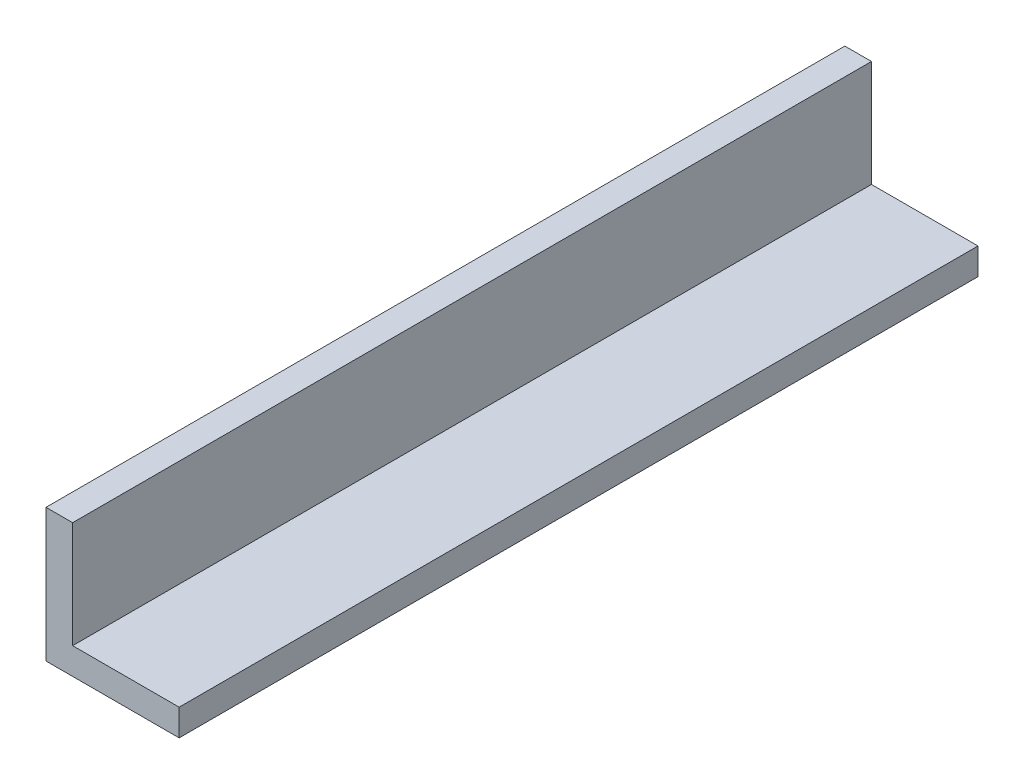
ISO-10303-21;
HEADER;
FILE_DESCRIPTION(('STEP AP214'),'2;1');
FILE_NAME('part.step','',(''),(''),'','','');
FILE_SCHEMA(('AUTOMOTIVE_DESIGN { 1 0 10303 214 1 1 1 1 }'));
ENDSEC;
DATA;
#1=APPLICATION_CONTEXT('core data for automotive mechanical design processes');
#2=APPLICATION_PROTOCOL_DEFINITION('international standard','automotive_design',2000,#1);
#3=PRODUCT_CONTEXT('',#1,'mechanical');
#4=PRODUCT('Part','Part','',(#3));
#5=PRODUCT_RELATED_PRODUCT_CATEGORY('part','',(#4));
#6=PRODUCT_DEFINITION_FORMATION('','',#4);
#7=PRODUCT_DEFINITION_CONTEXT('part definition',#1,'design');
#8=PRODUCT_DEFINITION('design','',#6,#7);
#9=PRODUCT_DEFINITION_SHAPE('','',#8);
#10=(LENGTH_UNIT() NAMED_UNIT(*) SI_UNIT(.MILLI.,.METRE.));
#11=(NAMED_UNIT(*) PLANE_ANGLE_UNIT() SI_UNIT($,.RADIAN.));
#12=(NAMED_UNIT(*) SI_UNIT($,.STERADIAN.) SOLID_ANGLE_UNIT());
#13=UNCERTAINTY_MEASURE_WITH_UNIT(LENGTH_MEASURE(1.E-05),#10,'distance_accuracy_value','');
#14=(GEOMETRIC_REPRESENTATION_CONTEXT(3) GLOBAL_UNCERTAINTY_ASSIGNED_CONTEXT((#13)) GLOBAL_UNIT_ASSIGNED_CONTEXT((#10,
#11,#12)) REPRESENTATION_CONTEXT('',''));
#15=CARTESIAN_POINT('',(0.,0.,0.));
#16=DIRECTION('',(0.,0.,1.));
#17=DIRECTION('',(1.,0.,0.));
#18=AXIS2_PLACEMENT_3D('',#15,#16,#17);
#19=CARTESIAN_POINT('',(5.08,-1.27,19.05));
#20=DIRECTION('',(-1.,0.,0.));
#21=DIRECTION('',(0.,0.,1.));
#22=AXIS2_PLACEMENT_3D('',#19,#20,#21);
#23=PLANE('',#22);
#24=DIRECTION('',(0.,1.,0.));
#25=VECTOR('',#24,1.);
#26=CARTESIAN_POINT('',(5.08,-1.27,-19.05));
#27=LINE('',#26,#25);
#28=CARTESIAN_POINT('',(5.08,-1.27,-19.05));
#29=VERTEX_POINT('',#28);
#30=CARTESIAN_POINT('',(5.08,0.,-19.05));
#31=VERTEX_POINT('',#30);
#32=EDGE_CURVE('E117',#29,#31,#27,.T.);
#33=ORIENTED_EDGE('',*,*,#32,.T.);
#34=DIRECTION('',(0.,0.,-1.));
#35=VECTOR('',#34,1.);
#36=CARTESIAN_POINT('',(5.08,0.,19.05));
#37=LINE('',#36,#35);
#38=CARTESIAN_POINT('',(5.08,0.,19.05));
#39=VERTEX_POINT('',#38);
#40=EDGE_CURVE('E11',#39,#31,#37,.T.);
#41=ORIENTED_EDGE('',*,*,#40,.F.);
#42=DIRECTION('',(0.,1.,0.));
#43=VECTOR('',#42,1.);
#44=CARTESIAN_POINT('',(5.08,-1.27,19.05));
#45=LINE('',#44,#43);
#46=CARTESIAN_POINT('',(5.08,-1.27,19.05));
#47=VERTEX_POINT('',#46);
#48=EDGE_CURVE('E127',#47,#39,#45,.T.);
#49=ORIENTED_EDGE('',*,*,#48,.F.);
#50=DIRECTION('',(0.,0.,-1.));
#51=VECTOR('',#50,1.);
#52=CARTESIAN_POINT('',(5.08,-1.27,19.05));
#53=LINE('',#52,#51);
#54=EDGE_CURVE('E113',#47,#29,#53,.T.);
#55=ORIENTED_EDGE('',*,*,#54,.T.);
#56=EDGE_LOOP('',(#33,#41,#49,#55));
#57=FACE_BOUND('',#56,.T.);
#58=ADVANCED_FACE('F33',(#57),#23,.F.);
#59=CARTESIAN_POINT('',(5.08,0.,19.05));
#60=DIRECTION('',(0.,-1.,0.));
#61=DIRECTION('',(1.,0.,0.));
#62=AXIS2_PLACEMENT_3D('',#59,#60,#61);
#63=PLANE('',#62);
#64=DIRECTION('',(-1.,0.,0.));
#65=VECTOR('',#64,1.);
#66=CARTESIAN_POINT('',(5.08,0.,-19.05));
#67=LINE('',#66,#65);
#68=CARTESIAN_POINT('',(0.,0.,-19.05));
#69=VERTEX_POINT('',#68);
#70=EDGE_CURVE('E120',#31,#69,#67,.T.);
#71=ORIENTED_EDGE('',*,*,#70,.T.);
#72=DIRECTION('',(0.,0.,-1.));
#73=VECTOR('',#72,1.);
#74=CARTESIAN_POINT('',(0.,0.,19.05));
#75=LINE('',#74,#73);
#76=CARTESIAN_POINT('',(0.,0.,19.05));
#77=VERTEX_POINT('',#76);
#78=EDGE_CURVE('E41',#77,#69,#75,.T.);
#79=ORIENTED_EDGE('',*,*,#78,.F.);
#80=DIRECTION('',(-1.,0.,0.));
#81=VECTOR('',#80,1.);
#82=CARTESIAN_POINT('',(5.08,0.,19.05));
#83=LINE('',#82,#81);
#84=EDGE_CURVE('E86',#39,#77,#83,.T.);
#85=ORIENTED_EDGE('',*,*,#84,.F.);
#86=ORIENTED_EDGE('',*,*,#40,.T.);
#87=EDGE_LOOP('',(#71,#79,#85,#86));
#88=FACE_BOUND('',#87,.T.);
#89=ADVANCED_FACE('F151',(#88),#63,.F.);
#90=CARTESIAN_POINT('',(0.,0.,19.05));
#91=DIRECTION('',(-1.,0.,0.));
#92=DIRECTION('',(0.,-1.,0.));
#93=AXIS2_PLACEMENT_3D('',#90,#91,#92);
#94=PLANE('',#93);
#95=DIRECTION('',(0.,1.,0.));
#96=VECTOR('',#95,1.);
#97=CARTESIAN_POINT('',(0.,0.,-19.05));
#98=LINE('',#97,#96);
#99=CARTESIAN_POINT('',(0.,5.08,-19.05));
#100=VERTEX_POINT('',#99);
#101=EDGE_CURVE('E122',#69,#100,#98,.T.);
#102=ORIENTED_EDGE('',*,*,#101,.T.);
#103=DIRECTION('',(0.,0.,-1.));
#104=VECTOR('',#103,1.);
#105=CARTESIAN_POINT('',(0.,5.08,19.05));
#106=LINE('',#105,#104);
#107=CARTESIAN_POINT('',(0.,5.08,19.05));
#108=VERTEX_POINT('',#107);
#109=EDGE_CURVE('E108',#108,#100,#106,.T.);
#110=ORIENTED_EDGE('',*,*,#109,.F.);
#111=DIRECTION('',(0.,1.,0.));
#112=VECTOR('',#111,1.);
#113=CARTESIAN_POINT('',(0.,0.,19.05));
#114=LINE('',#113,#112);
#115=EDGE_CURVE('E99',#77,#108,#114,.T.);
#116=ORIENTED_EDGE('',*,*,#115,.F.);
#117=ORIENTED_EDGE('',*,*,#78,.T.);
#118=EDGE_LOOP('',(#102,#110,#116,#117));
#119=FACE_BOUND('',#118,.T.);
#120=ADVANCED_FACE('F133',(#119),#94,.F.);
#121=CARTESIAN_POINT('',(0.,5.08,19.05));
#122=DIRECTION('',(0.,-1.,0.));
#123=DIRECTION('',(0.,0.,-1.));
#124=AXIS2_PLACEMENT_3D('',#121,#122,#123);
#125=PLANE('',#124);
#126=DIRECTION('',(-1.,0.,0.));
#127=VECTOR('',#126,1.);
#128=CARTESIAN_POINT('',(0.,5.08,-19.05));
#129=LINE('',#128,#127);
#130=CARTESIAN_POINT('',(-1.27,5.08,-19.05));
#131=VERTEX_POINT('',#130);
#132=EDGE_CURVE('E107',#100,#131,#129,.T.);
#133=ORIENTED_EDGE('',*,*,#132,.T.);
#134=DIRECTION('',(0.,0.,-1.));
#135=VECTOR('',#134,1.);
#136=CARTESIAN_POINT('',(-1.27,5.08,19.05));
#137=LINE('',#136,#135);
#138=CARTESIAN_POINT('',(-1.27,5.08,19.05));
#139=VERTEX_POINT('',#138);
#140=EDGE_CURVE('E104',#139,#131,#137,.T.);
#141=ORIENTED_EDGE('',*,*,#140,.F.);
#142=DIRECTION('',(-1.,0.,0.));
#143=VECTOR('',#142,1.);
#144=CARTESIAN_POINT('',(0.,5.08,19.05));
#145=LINE('',#144,#143);
#146=EDGE_CURVE('E93',#108,#139,#145,.T.);
#147=ORIENTED_EDGE('',*,*,#146,.F.);
#148=ORIENTED_EDGE('',*,*,#109,.T.);
#149=EDGE_LOOP('',(#133,#141,#147,#148));
#150=FACE_BOUND('',#149,.T.);
#151=ADVANCED_FACE('F105',(#150),#125,.F.);
#152=CARTESIAN_POINT('',(-1.27,5.08,19.05));
#153=DIRECTION('',(1.,0.,0.));
#154=DIRECTION('',(0.,1.,0.));
#155=AXIS2_PLACEMENT_3D('',#152,#153,#154);
#156=PLANE('',#155);
#157=DIRECTION('',(0.,-1.,0.));
#158=VECTOR('',#157,1.);
#159=CARTESIAN_POINT('',(-1.27,5.08,-19.05));
#160=LINE('',#159,#158);
#161=CARTESIAN_POINT('',(-1.27,-1.27,-19.05));
#162=VERTEX_POINT('',#161);
#163=EDGE_CURVE('E72',#131,#162,#160,.T.);
#164=ORIENTED_EDGE('',*,*,#163,.T.);
#165=DIRECTION('',(0.,0.,-1.));
#166=VECTOR('',#165,1.);
#167=CARTESIAN_POINT('',(-1.27,-1.27,19.05));
#168=LINE('',#167,#166);
#169=CARTESIAN_POINT('',(-1.27,-1.27,19.05));
#170=VERTEX_POINT('',#169);
#171=EDGE_CURVE('E109',#170,#162,#168,.T.);
#172=ORIENTED_EDGE('',*,*,#171,.F.);
#173=DIRECTION('',(0.,-1.,0.));
#174=VECTOR('',#173,1.);
#175=CARTESIAN_POINT('',(-1.27,5.08,19.05));
#176=LINE('',#175,#174);
#177=EDGE_CURVE('E97',#139,#170,#176,.T.);
#178=ORIENTED_EDGE('',*,*,#177,.F.);
#179=ORIENTED_EDGE('',*,*,#140,.T.);
#180=EDGE_LOOP('',(#164,#172,#178,#179));
#181=FACE_BOUND('',#180,.T.);
#182=ADVANCED_FACE('F111',(#181),#156,.F.);
#183=CARTESIAN_POINT('',(-1.27,-1.27,19.05));
#184=DIRECTION('',(0.,1.,0.));
#185=DIRECTION('',(-1.,0.,0.));
#186=AXIS2_PLACEMENT_3D('',#183,#184,#185);
#187=PLANE('',#186);
#188=DIRECTION('',(1.,0.,0.));
#189=VECTOR('',#188,1.);
#190=CARTESIAN_POINT('',(-1.27,-1.27,-19.05));
#191=LINE('',#190,#189);
#192=EDGE_CURVE('E78',#162,#29,#191,.T.);
#193=ORIENTED_EDGE('',*,*,#192,.T.);
#194=ORIENTED_EDGE('',*,*,#54,.F.);
#195=DIRECTION('',(1.,0.,0.));
#196=VECTOR('',#195,1.);
#197=CARTESIAN_POINT('',(-1.27,-1.27,19.05));
#198=LINE('',#197,#196);
#199=EDGE_CURVE('E49',#170,#47,#198,.T.);
#200=ORIENTED_EDGE('',*,*,#199,.F.);
#201=ORIENTED_EDGE('',*,*,#171,.T.);
#202=EDGE_LOOP('',(#193,#194,#200,#201));
#203=FACE_BOUND('',#202,.T.);
#204=ADVANCED_FACE('F140',(#203),#187,.F.);
#205=CARTESIAN_POINT('',(0.,0.,19.05));
#206=DIRECTION('',(0.,0.,1.));
#207=DIRECTION('',(1.,0.,0.));
#208=AXIS2_PLACEMENT_3D('',#205,#206,#207);
#209=PLANE('',#208);
#210=ORIENTED_EDGE('',*,*,#48,.T.);
#211=ORIENTED_EDGE('',*,*,#84,.T.);
#212=ORIENTED_EDGE('',*,*,#115,.T.);
#213=ORIENTED_EDGE('',*,*,#146,.T.);
#214=ORIENTED_EDGE('',*,*,#177,.T.);
#215=ORIENTED_EDGE('',*,*,#199,.T.);
#216=EDGE_LOOP('',(#210,#211,#212,#213,#214,#215));
#217=FACE_BOUND('',#216,.T.);
#218=ADVANCED_FACE('F95',(#217),#209,.T.);
#219=CARTESIAN_POINT('',(0.,0.,-19.05));
#220=DIRECTION('',(0.,0.,1.));
#221=DIRECTION('',(1.,0.,0.));
#222=AXIS2_PLACEMENT_3D('',#219,#220,#221);
#223=PLANE('',#222);
#224=ORIENTED_EDGE('',*,*,#32,.F.);
#225=ORIENTED_EDGE('',*,*,#192,.F.);
#226=ORIENTED_EDGE('',*,*,#163,.F.);
#227=ORIENTED_EDGE('',*,*,#132,.F.);
#228=ORIENTED_EDGE('',*,*,#101,.F.);
#229=ORIENTED_EDGE('',*,*,#70,.F.);
#230=EDGE_LOOP('',(#224,#225,#226,#227,#228,#229));
#231=FACE_BOUND('',#230,.T.);
#232=ADVANCED_FACE('F136',(#231),#223,.F.);
#233=CLOSED_SHELL('',(#58,#89,#120,#151,#182,#204,#218,#232));
#234=MANIFOLD_SOLID_BREP('B2',#233);
#235=ADVANCED_BREP_SHAPE_REPRESENTATION('',(#18,#234),#14);
#236=SHAPE_DEFINITION_REPRESENTATION(#9,#235);
ENDSEC;
END-ISO-10303-21;
